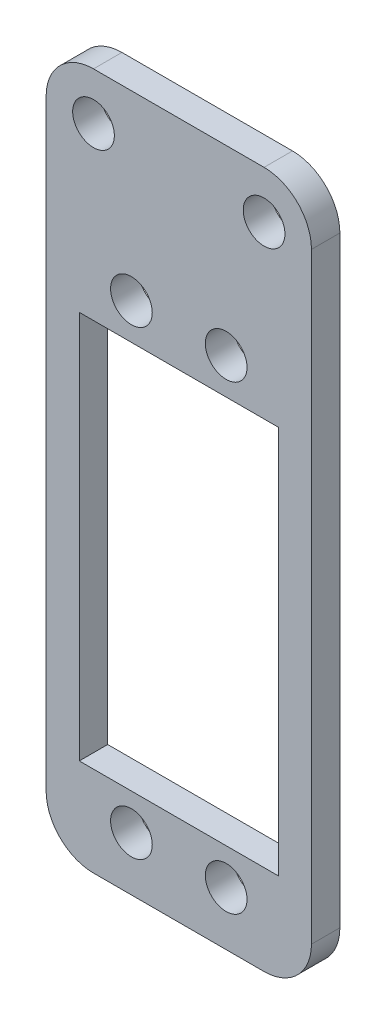
ISO-10303-21;
HEADER;
FILE_DESCRIPTION(('STEP AP214'),'2;1');
FILE_NAME('part.step','',(''),(''),'','','');
FILE_SCHEMA(('AUTOMOTIVE_DESIGN { 1 0 10303 214 1 1 1 1 }'));
ENDSEC;
DATA;
#1=APPLICATION_CONTEXT('core data for automotive mechanical design processes');
#2=APPLICATION_PROTOCOL_DEFINITION('international standard','automotive_design',2000,#1);
#3=PRODUCT_CONTEXT('',#1,'mechanical');
#4=PRODUCT('Part','Part','',(#3));
#5=PRODUCT_RELATED_PRODUCT_CATEGORY('part','',(#4));
#6=PRODUCT_DEFINITION_FORMATION('','',#4);
#7=PRODUCT_DEFINITION_CONTEXT('part definition',#1,'design');
#8=PRODUCT_DEFINITION('design','',#6,#7);
#9=PRODUCT_DEFINITION_SHAPE('','',#8);
#10=(LENGTH_UNIT() NAMED_UNIT(*) SI_UNIT(.MILLI.,.METRE.));
#11=(NAMED_UNIT(*) PLANE_ANGLE_UNIT() SI_UNIT($,.RADIAN.));
#12=(NAMED_UNIT(*) SI_UNIT($,.STERADIAN.) SOLID_ANGLE_UNIT());
#13=UNCERTAINTY_MEASURE_WITH_UNIT(LENGTH_MEASURE(1.E-05),#10,'distance_accuracy_value','');
#14=(GEOMETRIC_REPRESENTATION_CONTEXT(3) GLOBAL_UNCERTAINTY_ASSIGNED_CONTEXT((#13)) GLOBAL_UNIT_ASSIGNED_CONTEXT((#10,
#11,#12)) REPRESENTATION_CONTEXT('',''));
#15=CARTESIAN_POINT('',(0.,0.,0.));
#16=DIRECTION('',(0.,0.,1.));
#17=DIRECTION('',(1.,0.,0.));
#18=AXIS2_PLACEMENT_3D('',#15,#16,#17);
#19=CARTESIAN_POINT('',(-9.00000000000001,35.,3.));
#20=DIRECTION('',(0.,0.,-1.));
#21=DIRECTION('',(-1.,0.,0.));
#22=AXIS2_PLACEMENT_3D('',#19,#20,#21);
#23=PLANE('',#22);
#24=CARTESIAN_POINT('',(-9.00000000000001,35.,3.));
#25=DIRECTION('',(0.,0.,1.));
#26=DIRECTION('',(1.,0.,0.));
#27=AXIS2_PLACEMENT_3D('',#24,#25,#26);
#28=CIRCLE('',#27,2.2);
#29=CARTESIAN_POINT('',(-6.8,35.,3.));
#30=VERTEX_POINT('',#29);
#31=EDGE_CURVE('E366',#30,#30,#28,.T.);
#32=ORIENTED_EDGE('',*,*,#31,.F.);
#33=EDGE_LOOP('',(#32));
#34=FACE_BOUND('',#33,.T.);
#35=CARTESIAN_POINT('',(9.,35.,3.));
#36=DIRECTION('',(0.,0.,1.));
#37=DIRECTION('',(1.,0.,0.));
#38=AXIS2_PLACEMENT_3D('',#35,#36,#37);
#39=CIRCLE('',#38,2.2);
#40=CARTESIAN_POINT('',(11.2,35.,3.));
#41=VERTEX_POINT('',#40);
#42=EDGE_CURVE('E314',#41,#41,#39,.T.);
#43=ORIENTED_EDGE('',*,*,#42,.F.);
#44=EDGE_LOOP('',(#43));
#45=FACE_BOUND('',#44,.T.);
#46=DIRECTION('',(-1.,0.,0.));
#47=VECTOR('',#46,1.);
#48=CARTESIAN_POINT('',(0.,17.,3.));
#49=LINE('',#48,#47);
#50=CARTESIAN_POINT('',(10.5000000000001,17.,3.));
#51=VERTEX_POINT('',#50);
#52=CARTESIAN_POINT('',(-10.4999999999999,17.,3.));
#53=VERTEX_POINT('',#52);
#54=EDGE_CURVE('E156',#51,#53,#49,.T.);
#55=ORIENTED_EDGE('',*,*,#54,.F.);
#56=DIRECTION('',(0.,1.,0.));
#57=VECTOR('',#56,1.);
#58=CARTESIAN_POINT('',(10.5000000000001,0.,3.));
#59=LINE('',#58,#57);
#60=CARTESIAN_POINT('',(10.5000000000001,-24.,3.));
#61=VERTEX_POINT('',#60);
#62=EDGE_CURVE('E54',#61,#51,#59,.T.);
#63=ORIENTED_EDGE('',*,*,#62,.F.);
#64=DIRECTION('',(-1.,0.,0.));
#65=VECTOR('',#64,1.);
#66=CARTESIAN_POINT('',(0.,-24.,3.));
#67=LINE('',#66,#65);
#68=CARTESIAN_POINT('',(-10.4999999999999,-24.,3.));
#69=VERTEX_POINT('',#68);
#70=EDGE_CURVE('E144',#61,#69,#67,.T.);
#71=ORIENTED_EDGE('',*,*,#70,.T.);
#72=DIRECTION('',(0.,1.,0.));
#73=VECTOR('',#72,1.);
#74=CARTESIAN_POINT('',(-10.4999999999999,0.,3.));
#75=LINE('',#74,#73);
#76=EDGE_CURVE('E147',#69,#53,#75,.T.);
#77=ORIENTED_EDGE('',*,*,#76,.T.);
#78=EDGE_LOOP('',(#55,#63,#71,#77));
#79=FACE_BOUND('',#78,.T.);
#80=CARTESIAN_POINT('',(4.99999999999998,20.815,3.));
#81=DIRECTION('',(0.,0.,1.));
#82=DIRECTION('',(1.,0.,0.));
#83=AXIS2_PLACEMENT_3D('',#80,#81,#82);
#84=CIRCLE('',#83,2.2);
#85=CARTESIAN_POINT('',(7.19999999999998,20.815,3.));
#86=VERTEX_POINT('',#85);
#87=EDGE_CURVE('E319',#86,#86,#84,.T.);
#88=ORIENTED_EDGE('',*,*,#87,.F.);
#89=EDGE_LOOP('',(#88));
#90=FACE_BOUND('',#89,.T.);
#91=CARTESIAN_POINT('',(-4.99999999999999,20.815,3.));
#92=DIRECTION('',(0.,0.,1.));
#93=DIRECTION('',(1.,0.,0.));
#94=AXIS2_PLACEMENT_3D('',#91,#92,#93);
#95=CIRCLE('',#94,2.2);
#96=CARTESIAN_POINT('',(-2.79999999999999,20.815,3.));
#97=VERTEX_POINT('',#96);
#98=EDGE_CURVE('E170',#97,#97,#95,.F.);
#99=ORIENTED_EDGE('',*,*,#98,.T.);
#100=EDGE_LOOP('',(#99));
#101=FACE_BOUND('',#100,.T.);
#102=CARTESIAN_POINT('',(-9.00000000000001,35.,3.));
#103=DIRECTION('',(0.,0.,1.));
#104=DIRECTION('',(-1.,0.,0.));
#105=AXIS2_PLACEMENT_3D('',#102,#103,#104);
#106=CIRCLE('',#105,5.);
#107=CARTESIAN_POINT('',(-9.00000000000001,40.,3.));
#108=VERTEX_POINT('',#107);
#109=CARTESIAN_POINT('',(-14.,35.,3.));
#110=VERTEX_POINT('',#109);
#111=EDGE_CURVE('E174',#108,#110,#106,.T.);
#112=ORIENTED_EDGE('',*,*,#111,.T.);
#113=DIRECTION('',(0.,-1.,0.));
#114=VECTOR('',#113,1.);
#115=CARTESIAN_POINT('',(-14.,35.,3.));
#116=LINE('',#115,#114);
#117=CARTESIAN_POINT('',(-14.,-28.5,3.));
#118=VERTEX_POINT('',#117);
#119=EDGE_CURVE('E177',#110,#118,#116,.T.);
#120=ORIENTED_EDGE('',*,*,#119,.T.);
#121=CARTESIAN_POINT('',(-9.00000000000001,-28.5,3.));
#122=DIRECTION('',(0.,0.,1.));
#123=DIRECTION('',(-1.,0.,0.));
#124=AXIS2_PLACEMENT_3D('',#121,#122,#123);
#125=CIRCLE('',#124,5.);
#126=CARTESIAN_POINT('',(-8.99999999999997,-33.5,3.));
#127=VERTEX_POINT('',#126);
#128=EDGE_CURVE('E180',#118,#127,#125,.T.);
#129=ORIENTED_EDGE('',*,*,#128,.T.);
#130=DIRECTION('',(1.,0.,0.));
#131=VECTOR('',#130,1.);
#132=CARTESIAN_POINT('',(-8.99999999999997,-33.5,3.));
#133=LINE('',#132,#131);
#134=CARTESIAN_POINT('',(8.99999999999997,-33.5,3.));
#135=VERTEX_POINT('',#134);
#136=EDGE_CURVE('E182',#127,#135,#133,.T.);
#137=ORIENTED_EDGE('',*,*,#136,.T.);
#138=CARTESIAN_POINT('',(9.,-28.5,3.));
#139=DIRECTION('',(0.,0.,1.));
#140=DIRECTION('',(1.,0.,0.));
#141=AXIS2_PLACEMENT_3D('',#138,#139,#140);
#142=CIRCLE('',#141,5.);
#143=CARTESIAN_POINT('',(14.,-28.5,3.));
#144=VERTEX_POINT('',#143);
#145=EDGE_CURVE('E184',#135,#144,#142,.T.);
#146=ORIENTED_EDGE('',*,*,#145,.T.);
#147=DIRECTION('',(0.,1.,0.));
#148=VECTOR('',#147,1.);
#149=CARTESIAN_POINT('',(14.,35.,3.));
#150=LINE('',#149,#148);
#151=CARTESIAN_POINT('',(14.,35.,3.));
#152=VERTEX_POINT('',#151);
#153=EDGE_CURVE('E186',#144,#152,#150,.T.);
#154=ORIENTED_EDGE('',*,*,#153,.T.);
#155=CARTESIAN_POINT('',(9.,35.,3.));
#156=DIRECTION('',(0.,0.,1.));
#157=DIRECTION('',(1.,0.,0.));
#158=AXIS2_PLACEMENT_3D('',#155,#156,#157);
#159=CIRCLE('',#158,5.);
#160=CARTESIAN_POINT('',(9.,40.,3.));
#161=VERTEX_POINT('',#160);
#162=EDGE_CURVE('E188',#152,#161,#159,.T.);
#163=ORIENTED_EDGE('',*,*,#162,.T.);
#164=DIRECTION('',(-1.,0.,0.));
#165=VECTOR('',#164,1.);
#166=CARTESIAN_POINT('',(-9.00000000000001,40.,3.));
#167=LINE('',#166,#165);
#168=EDGE_CURVE('E190',#161,#108,#167,.T.);
#169=ORIENTED_EDGE('',*,*,#168,.T.);
#170=EDGE_LOOP('',(#112,#120,#129,#137,#146,#154,#163,#169));
#171=FACE_BOUND('',#170,.T.);
#172=CARTESIAN_POINT('',(4.99999999999999,-27.815,3.));
#173=DIRECTION('',(0.,0.,1.));
#174=DIRECTION('',(1.,0.,0.));
#175=AXIS2_PLACEMENT_3D('',#172,#173,#174);
#176=CIRCLE('',#175,2.2);
#177=CARTESIAN_POINT('',(7.19999999999999,-27.815,3.));
#178=VERTEX_POINT('',#177);
#179=EDGE_CURVE('E308',#178,#178,#176,.F.);
#180=ORIENTED_EDGE('',*,*,#179,.T.);
#181=EDGE_LOOP('',(#180));
#182=FACE_BOUND('',#181,.T.);
#183=CARTESIAN_POINT('',(-4.99999999999999,-27.815,3.));
#184=DIRECTION('',(0.,0.,1.));
#185=DIRECTION('',(1.,0.,0.));
#186=AXIS2_PLACEMENT_3D('',#183,#184,#185);
#187=CIRCLE('',#186,2.2);
#188=CARTESIAN_POINT('',(-2.79999999999999,-27.815,3.));
#189=VERTEX_POINT('',#188);
#190=EDGE_CURVE('E150',#189,#189,#187,.T.);
#191=ORIENTED_EDGE('',*,*,#190,.F.);
#192=EDGE_LOOP('',(#191));
#193=FACE_BOUND('',#192,.T.);
#194=ADVANCED_FACE('F39',(#34,#45,#79,#90,#101,#171,#182,#193),#23,.F.);
#195=CARTESIAN_POINT('',(-9.00000000000001,35.,0.));
#196=DIRECTION('',(0.,0.,-1.));
#197=DIRECTION('',(-1.,0.,0.));
#198=AXIS2_PLACEMENT_3D('',#195,#196,#197);
#199=PLANE('',#198);
#200=CARTESIAN_POINT('',(-9.00000000000001,35.,0.));
#201=DIRECTION('',(0.,0.,1.));
#202=DIRECTION('',(1.,0.,0.));
#203=AXIS2_PLACEMENT_3D('',#200,#201,#202);
#204=CIRCLE('',#203,2.2);
#205=CARTESIAN_POINT('',(-6.8,35.,0.));
#206=VERTEX_POINT('',#205);
#207=EDGE_CURVE('E321',#206,#206,#204,.T.);
#208=ORIENTED_EDGE('',*,*,#207,.T.);
#209=EDGE_LOOP('',(#208));
#210=FACE_BOUND('',#209,.T.);
#211=CARTESIAN_POINT('',(9.,35.,0.));
#212=DIRECTION('',(0.,0.,1.));
#213=DIRECTION('',(1.,0.,0.));
#214=AXIS2_PLACEMENT_3D('',#211,#212,#213);
#215=CIRCLE('',#214,2.2);
#216=CARTESIAN_POINT('',(11.2,35.,0.));
#217=VERTEX_POINT('',#216);
#218=EDGE_CURVE('E367',#217,#217,#215,.T.);
#219=ORIENTED_EDGE('',*,*,#218,.T.);
#220=EDGE_LOOP('',(#219));
#221=FACE_BOUND('',#220,.T.);
#222=CARTESIAN_POINT('',(4.99999999999998,20.815,0.));
#223=DIRECTION('',(0.,0.,1.));
#224=DIRECTION('',(1.,0.,0.));
#225=AXIS2_PLACEMENT_3D('',#222,#223,#224);
#226=CIRCLE('',#225,2.2);
#227=CARTESIAN_POINT('',(7.19999999999998,20.815,0.));
#228=VERTEX_POINT('',#227);
#229=EDGE_CURVE('E311',#228,#228,#226,.T.);
#230=ORIENTED_EDGE('',*,*,#229,.T.);
#231=EDGE_LOOP('',(#230));
#232=FACE_BOUND('',#231,.T.);
#233=CARTESIAN_POINT('',(-9.00000000000001,35.,0.));
#234=DIRECTION('',(0.,0.,1.));
#235=DIRECTION('',(-1.,0.,0.));
#236=AXIS2_PLACEMENT_3D('',#233,#234,#235);
#237=CIRCLE('',#236,5.);
#238=CARTESIAN_POINT('',(-9.00000000000001,40.,0.));
#239=VERTEX_POINT('',#238);
#240=CARTESIAN_POINT('',(-14.,35.,0.));
#241=VERTEX_POINT('',#240);
#242=EDGE_CURVE('E169',#239,#241,#237,.T.);
#243=ORIENTED_EDGE('',*,*,#242,.F.);
#244=DIRECTION('',(-1.,0.,0.));
#245=VECTOR('',#244,1.);
#246=CARTESIAN_POINT('',(-9.00000000000001,40.,0.));
#247=LINE('',#246,#245);
#248=CARTESIAN_POINT('',(9.,40.,0.));
#249=VERTEX_POINT('',#248);
#250=EDGE_CURVE('E178',#249,#239,#247,.T.);
#251=ORIENTED_EDGE('',*,*,#250,.F.);
#252=CARTESIAN_POINT('',(9.,35.,0.));
#253=DIRECTION('',(0.,0.,1.));
#254=DIRECTION('',(1.,0.,0.));
#255=AXIS2_PLACEMENT_3D('',#252,#253,#254);
#256=CIRCLE('',#255,5.);
#257=CARTESIAN_POINT('',(14.,35.,0.));
#258=VERTEX_POINT('',#257);
#259=EDGE_CURVE('E205',#258,#249,#256,.T.);
#260=ORIENTED_EDGE('',*,*,#259,.F.);
#261=DIRECTION('',(0.,1.,0.));
#262=VECTOR('',#261,1.);
#263=CARTESIAN_POINT('',(14.,35.,0.));
#264=LINE('',#263,#262);
#265=CARTESIAN_POINT('',(14.,-28.5,0.));
#266=VERTEX_POINT('',#265);
#267=EDGE_CURVE('E203',#266,#258,#264,.T.);
#268=ORIENTED_EDGE('',*,*,#267,.F.);
#269=CARTESIAN_POINT('',(9.,-28.5,0.));
#270=DIRECTION('',(0.,0.,1.));
#271=DIRECTION('',(1.,0.,0.));
#272=AXIS2_PLACEMENT_3D('',#269,#270,#271);
#273=CIRCLE('',#272,5.);
#274=CARTESIAN_POINT('',(8.99999999999997,-33.5,0.));
#275=VERTEX_POINT('',#274);
#276=EDGE_CURVE('E201',#275,#266,#273,.T.);
#277=ORIENTED_EDGE('',*,*,#276,.F.);
#278=DIRECTION('',(1.,0.,0.));
#279=VECTOR('',#278,1.);
#280=CARTESIAN_POINT('',(-8.99999999999997,-33.5,0.));
#281=LINE('',#280,#279);
#282=CARTESIAN_POINT('',(-8.99999999999997,-33.5,0.));
#283=VERTEX_POINT('',#282);
#284=EDGE_CURVE('E199',#283,#275,#281,.T.);
#285=ORIENTED_EDGE('',*,*,#284,.F.);
#286=CARTESIAN_POINT('',(-9.00000000000001,-28.5,0.));
#287=DIRECTION('',(0.,0.,1.));
#288=DIRECTION('',(-1.,0.,0.));
#289=AXIS2_PLACEMENT_3D('',#286,#287,#288);
#290=CIRCLE('',#289,5.);
#291=CARTESIAN_POINT('',(-14.,-28.5,0.));
#292=VERTEX_POINT('',#291);
#293=EDGE_CURVE('E197',#292,#283,#290,.T.);
#294=ORIENTED_EDGE('',*,*,#293,.F.);
#295=DIRECTION('',(0.,-1.,0.));
#296=VECTOR('',#295,1.);
#297=CARTESIAN_POINT('',(-14.,35.,0.));
#298=LINE('',#297,#296);
#299=EDGE_CURVE('E195',#241,#292,#298,.T.);
#300=ORIENTED_EDGE('',*,*,#299,.F.);
#301=EDGE_LOOP('',(#243,#251,#260,#268,#277,#285,#294,#300));
#302=FACE_BOUND('',#301,.T.);
#303=CARTESIAN_POINT('',(-4.99999999999999,20.815,0.));
#304=DIRECTION('',(0.,0.,1.));
#305=DIRECTION('',(1.,0.,0.));
#306=AXIS2_PLACEMENT_3D('',#303,#304,#305);
#307=CIRCLE('',#306,2.2);
#308=CARTESIAN_POINT('',(-2.79999999999999,20.815,0.));
#309=VERTEX_POINT('',#308);
#310=EDGE_CURVE('E166',#309,#309,#307,.F.);
#311=ORIENTED_EDGE('',*,*,#310,.F.);
#312=EDGE_LOOP('',(#311));
#313=FACE_BOUND('',#312,.T.);
#314=CARTESIAN_POINT('',(4.99999999999999,-27.815,0.));
#315=DIRECTION('',(0.,0.,1.));
#316=DIRECTION('',(1.,0.,0.));
#317=AXIS2_PLACEMENT_3D('',#314,#315,#316);
#318=CIRCLE('',#317,2.2);
#319=CARTESIAN_POINT('',(7.19999999999999,-27.815,0.));
#320=VERTEX_POINT('',#319);
#321=EDGE_CURVE('E157',#320,#320,#318,.F.);
#322=ORIENTED_EDGE('',*,*,#321,.F.);
#323=EDGE_LOOP('',(#322));
#324=FACE_BOUND('',#323,.T.);
#325=DIRECTION('',(0.,1.,0.));
#326=VECTOR('',#325,1.);
#327=CARTESIAN_POINT('',(10.5000000000001,0.,0.));
#328=LINE('',#327,#326);
#329=CARTESIAN_POINT('',(10.5000000000001,-24.,0.));
#330=VERTEX_POINT('',#329);
#331=CARTESIAN_POINT('',(10.5000000000001,17.,0.));
#332=VERTEX_POINT('',#331);
#333=EDGE_CURVE('E130',#330,#332,#328,.T.);
#334=ORIENTED_EDGE('',*,*,#333,.T.);
#335=DIRECTION('',(-1.,0.,0.));
#336=VECTOR('',#335,1.);
#337=CARTESIAN_POINT('',(0.,17.,0.));
#338=LINE('',#337,#336);
#339=CARTESIAN_POINT('',(-10.4999999999999,17.,0.));
#340=VERTEX_POINT('',#339);
#341=EDGE_CURVE('E136',#332,#340,#338,.T.);
#342=ORIENTED_EDGE('',*,*,#341,.T.);
#343=DIRECTION('',(0.,1.,0.));
#344=VECTOR('',#343,1.);
#345=CARTESIAN_POINT('',(-10.4999999999999,0.,0.));
#346=LINE('',#345,#344);
#347=CARTESIAN_POINT('',(-10.4999999999999,-24.,0.));
#348=VERTEX_POINT('',#347);
#349=EDGE_CURVE('E140',#348,#340,#346,.T.);
#350=ORIENTED_EDGE('',*,*,#349,.F.);
#351=DIRECTION('',(-1.,0.,0.));
#352=VECTOR('',#351,1.);
#353=CARTESIAN_POINT('',(0.,-24.,0.));
#354=LINE('',#353,#352);
#355=EDGE_CURVE('E133',#330,#348,#354,.T.);
#356=ORIENTED_EDGE('',*,*,#355,.F.);
#357=EDGE_LOOP('',(#334,#342,#350,#356));
#358=FACE_BOUND('',#357,.T.);
#359=CARTESIAN_POINT('',(-4.99999999999999,-27.815,0.));
#360=DIRECTION('',(0.,0.,1.));
#361=DIRECTION('',(1.,0.,0.));
#362=AXIS2_PLACEMENT_3D('',#359,#360,#361);
#363=CIRCLE('',#362,2.2);
#364=CARTESIAN_POINT('',(-2.79999999999999,-27.815,0.));
#365=VERTEX_POINT('',#364);
#366=EDGE_CURVE('E173',#365,#365,#363,.T.);
#367=ORIENTED_EDGE('',*,*,#366,.T.);
#368=EDGE_LOOP('',(#367));
#369=FACE_BOUND('',#368,.T.);
#370=ADVANCED_FACE('F142',(#210,#221,#232,#302,#313,#324,#358,#369),#199,.T.);
#371=CARTESIAN_POINT('',(-9.00000000000001,35.,3.));
#372=DIRECTION('',(0.,0.,-1.));
#373=DIRECTION('',(-1.,0.,0.));
#374=AXIS2_PLACEMENT_3D('',#371,#372,#373);
#375=CYLINDRICAL_SURFACE('',#374,5.);
#376=ORIENTED_EDGE('',*,*,#242,.T.);
#377=DIRECTION('',(0.,0.,-1.));
#378=VECTOR('',#377,1.);
#379=CARTESIAN_POINT('',(-14.,35.,3.));
#380=LINE('',#379,#378);
#381=EDGE_CURVE('E11',#110,#241,#380,.T.);
#382=ORIENTED_EDGE('',*,*,#381,.F.);
#383=ORIENTED_EDGE('',*,*,#111,.F.);
#384=DIRECTION('',(0.,0.,-1.));
#385=VECTOR('',#384,1.);
#386=CARTESIAN_POINT('',(-9.00000000000001,40.,3.));
#387=LINE('',#386,#385);
#388=EDGE_CURVE('E192',#108,#239,#387,.T.);
#389=ORIENTED_EDGE('',*,*,#388,.T.);
#390=EDGE_LOOP('',(#376,#382,#383,#389));
#391=FACE_BOUND('',#390,.T.);
#392=ADVANCED_FACE('F41',(#391),#375,.T.);
#393=CARTESIAN_POINT('',(-14.,35.,3.));
#394=DIRECTION('',(1.,0.,0.));
#395=DIRECTION('',(0.,1.,0.));
#396=AXIS2_PLACEMENT_3D('',#393,#394,#395);
#397=PLANE('',#396);
#398=ORIENTED_EDGE('',*,*,#299,.T.);
#399=DIRECTION('',(0.,0.,-1.));
#400=VECTOR('',#399,1.);
#401=CARTESIAN_POINT('',(-14.,-28.5,3.));
#402=LINE('',#401,#400);
#403=EDGE_CURVE('E47',#118,#292,#402,.T.);
#404=ORIENTED_EDGE('',*,*,#403,.F.);
#405=ORIENTED_EDGE('',*,*,#119,.F.);
#406=ORIENTED_EDGE('',*,*,#381,.T.);
#407=EDGE_LOOP('',(#398,#404,#405,#406));
#408=FACE_BOUND('',#407,.T.);
#409=ADVANCED_FACE('F252',(#408),#397,.F.);
#410=CARTESIAN_POINT('',(-9.00000000000001,-28.5,3.));
#411=DIRECTION('',(0.,0.,-1.));
#412=DIRECTION('',(-1.,0.,0.));
#413=AXIS2_PLACEMENT_3D('',#410,#411,#412);
#414=CYLINDRICAL_SURFACE('',#413,5.);
#415=ORIENTED_EDGE('',*,*,#293,.T.);
#416=DIRECTION('',(0.,0.,-1.));
#417=VECTOR('',#416,1.);
#418=CARTESIAN_POINT('',(-8.99999999999997,-33.5,3.));
#419=LINE('',#418,#417);
#420=EDGE_CURVE('E222',#127,#283,#419,.T.);
#421=ORIENTED_EDGE('',*,*,#420,.F.);
#422=ORIENTED_EDGE('',*,*,#128,.F.);
#423=ORIENTED_EDGE('',*,*,#403,.T.);
#424=EDGE_LOOP('',(#415,#421,#422,#423));
#425=FACE_BOUND('',#424,.T.);
#426=ADVANCED_FACE('F229',(#425),#414,.T.);
#427=CARTESIAN_POINT('',(-8.99999999999997,-33.5,3.));
#428=DIRECTION('',(0.,1.,0.));
#429=DIRECTION('',(0.,0.,1.));
#430=AXIS2_PLACEMENT_3D('',#427,#428,#429);
#431=PLANE('',#430);
#432=ORIENTED_EDGE('',*,*,#284,.T.);
#433=DIRECTION('',(0.,0.,-1.));
#434=VECTOR('',#433,1.);
#435=CARTESIAN_POINT('',(8.99999999999997,-33.5,3.));
#436=LINE('',#435,#434);
#437=EDGE_CURVE('E219',#135,#275,#436,.T.);
#438=ORIENTED_EDGE('',*,*,#437,.F.);
#439=ORIENTED_EDGE('',*,*,#136,.F.);
#440=ORIENTED_EDGE('',*,*,#420,.T.);
#441=EDGE_LOOP('',(#432,#438,#439,#440));
#442=FACE_BOUND('',#441,.T.);
#443=ADVANCED_FACE('F240',(#442),#431,.F.);
#444=CARTESIAN_POINT('',(9.,-28.5,3.));
#445=DIRECTION('',(0.,0.,-1.));
#446=DIRECTION('',(-1.,0.,0.));
#447=AXIS2_PLACEMENT_3D('',#444,#445,#446);
#448=CYLINDRICAL_SURFACE('',#447,5.);
#449=ORIENTED_EDGE('',*,*,#276,.T.);
#450=DIRECTION('',(0.,0.,-1.));
#451=VECTOR('',#450,1.);
#452=CARTESIAN_POINT('',(14.,-28.5,3.));
#453=LINE('',#452,#451);
#454=EDGE_CURVE('E216',#144,#266,#453,.T.);
#455=ORIENTED_EDGE('',*,*,#454,.F.);
#456=ORIENTED_EDGE('',*,*,#145,.F.);
#457=ORIENTED_EDGE('',*,*,#437,.T.);
#458=EDGE_LOOP('',(#449,#455,#456,#457));
#459=FACE_BOUND('',#458,.T.);
#460=ADVANCED_FACE('F244',(#459),#448,.T.);
#461=CARTESIAN_POINT('',(14.,35.,3.));
#462=DIRECTION('',(-1.,0.,0.));
#463=DIRECTION('',(0.,-1.,0.));
#464=AXIS2_PLACEMENT_3D('',#461,#462,#463);
#465=PLANE('',#464);
#466=ORIENTED_EDGE('',*,*,#267,.T.);
#467=DIRECTION('',(0.,0.,-1.));
#468=VECTOR('',#467,1.);
#469=CARTESIAN_POINT('',(14.,35.,3.));
#470=LINE('',#469,#468);
#471=EDGE_CURVE('E213',#152,#258,#470,.T.);
#472=ORIENTED_EDGE('',*,*,#471,.F.);
#473=ORIENTED_EDGE('',*,*,#153,.F.);
#474=ORIENTED_EDGE('',*,*,#454,.T.);
#475=EDGE_LOOP('',(#466,#472,#473,#474));
#476=FACE_BOUND('',#475,.T.);
#477=ADVANCED_FACE('F265',(#476),#465,.F.);
#478=CARTESIAN_POINT('',(9.,35.,3.));
#479=DIRECTION('',(0.,0.,-1.));
#480=DIRECTION('',(-1.,0.,0.));
#481=AXIS2_PLACEMENT_3D('',#478,#479,#480);
#482=CYLINDRICAL_SURFACE('',#481,5.);
#483=ORIENTED_EDGE('',*,*,#259,.T.);
#484=DIRECTION('',(0.,0.,-1.));
#485=VECTOR('',#484,1.);
#486=CARTESIAN_POINT('',(9.,40.,3.));
#487=LINE('',#486,#485);
#488=EDGE_CURVE('E210',#161,#249,#487,.T.);
#489=ORIENTED_EDGE('',*,*,#488,.F.);
#490=ORIENTED_EDGE('',*,*,#162,.F.);
#491=ORIENTED_EDGE('',*,*,#471,.T.);
#492=EDGE_LOOP('',(#483,#489,#490,#491));
#493=FACE_BOUND('',#492,.T.);
#494=ADVANCED_FACE('F263',(#493),#482,.T.);
#495=CARTESIAN_POINT('',(-9.00000000000001,40.,3.));
#496=DIRECTION('',(0.,-1.,0.));
#497=DIRECTION('',(1.,0.,0.));
#498=AXIS2_PLACEMENT_3D('',#495,#496,#497);
#499=PLANE('',#498);
#500=ORIENTED_EDGE('',*,*,#250,.T.);
#501=ORIENTED_EDGE('',*,*,#388,.F.);
#502=ORIENTED_EDGE('',*,*,#168,.F.);
#503=ORIENTED_EDGE('',*,*,#488,.T.);
#504=EDGE_LOOP('',(#500,#501,#502,#503));
#505=FACE_BOUND('',#504,.T.);
#506=ADVANCED_FACE('F258',(#505),#499,.F.);
#507=CARTESIAN_POINT('',(-4.99999999999999,20.815,0.));
#508=DIRECTION('',(0.,0.,1.));
#509=DIRECTION('',(1.,0.,0.));
#510=AXIS2_PLACEMENT_3D('',#507,#508,#509);
#511=CYLINDRICAL_SURFACE('',#510,2.2);
#512=ORIENTED_EDGE('',*,*,#310,.T.);
#513=EDGE_LOOP('',(#512));
#514=FACE_BOUND('',#513,.T.);
#515=ORIENTED_EDGE('',*,*,#98,.F.);
#516=EDGE_LOOP('',(#515));
#517=FACE_BOUND('',#516,.T.);
#518=ADVANCED_FACE('F285',(#514,#517),#511,.F.);
#519=CARTESIAN_POINT('',(4.99999999999998,20.815,0.));
#520=DIRECTION('',(0.,0.,1.));
#521=DIRECTION('',(1.,0.,0.));
#522=AXIS2_PLACEMENT_3D('',#519,#520,#521);
#523=CYLINDRICAL_SURFACE('',#522,2.2);
#524=ORIENTED_EDGE('',*,*,#229,.F.);
#525=EDGE_LOOP('',(#524));
#526=FACE_BOUND('',#525,.T.);
#527=ORIENTED_EDGE('',*,*,#87,.T.);
#528=EDGE_LOOP('',(#527));
#529=FACE_BOUND('',#528,.T.);
#530=ADVANCED_FACE('F292',(#526,#529),#523,.F.);
#531=CARTESIAN_POINT('',(4.99999999999999,-27.815,0.));
#532=DIRECTION('',(0.,0.,1.));
#533=DIRECTION('',(1.,0.,0.));
#534=AXIS2_PLACEMENT_3D('',#531,#532,#533);
#535=CYLINDRICAL_SURFACE('',#534,2.2);
#536=ORIENTED_EDGE('',*,*,#321,.T.);
#537=EDGE_LOOP('',(#536));
#538=FACE_BOUND('',#537,.T.);
#539=ORIENTED_EDGE('',*,*,#179,.F.);
#540=EDGE_LOOP('',(#539));
#541=FACE_BOUND('',#540,.T.);
#542=ADVANCED_FACE('F297',(#538,#541),#535,.F.);
#543=CARTESIAN_POINT('',(10.5000000000001,0.,0.));
#544=DIRECTION('',(1.,0.,0.));
#545=DIRECTION('',(0.,0.,-1.));
#546=AXIS2_PLACEMENT_3D('',#543,#544,#545);
#547=PLANE('',#546);
#548=ORIENTED_EDGE('',*,*,#62,.T.);
#549=DIRECTION('',(0.,0.,1.));
#550=VECTOR('',#549,1.);
#551=CARTESIAN_POINT('',(10.5000000000001,17.,0.));
#552=LINE('',#551,#550);
#553=EDGE_CURVE('E127',#332,#51,#552,.T.);
#554=ORIENTED_EDGE('',*,*,#553,.F.);
#555=ORIENTED_EDGE('',*,*,#333,.F.);
#556=DIRECTION('',(0.,0.,1.));
#557=VECTOR('',#556,1.);
#558=CARTESIAN_POINT('',(10.5000000000001,-24.,0.));
#559=LINE('',#558,#557);
#560=EDGE_CURVE('E161',#330,#61,#559,.T.);
#561=ORIENTED_EDGE('',*,*,#560,.T.);
#562=EDGE_LOOP('',(#548,#554,#555,#561));
#563=FACE_BOUND('',#562,.T.);
#564=ADVANCED_FACE('F128',(#563),#547,.F.);
#565=CARTESIAN_POINT('',(0.,-24.,0.));
#566=DIRECTION('',(0.,1.,0.));
#567=DIRECTION('',(0.,0.,1.));
#568=AXIS2_PLACEMENT_3D('',#565,#566,#567);
#569=PLANE('',#568);
#570=ORIENTED_EDGE('',*,*,#70,.F.);
#571=ORIENTED_EDGE('',*,*,#560,.F.);
#572=ORIENTED_EDGE('',*,*,#355,.T.);
#573=DIRECTION('',(0.,0.,1.));
#574=VECTOR('',#573,1.);
#575=CARTESIAN_POINT('',(-10.4999999999999,-24.,0.));
#576=LINE('',#575,#574);
#577=EDGE_CURVE('E163',#348,#69,#576,.T.);
#578=ORIENTED_EDGE('',*,*,#577,.T.);
#579=EDGE_LOOP('',(#570,#571,#572,#578));
#580=FACE_BOUND('',#579,.T.);
#581=ADVANCED_FACE('F344',(#580),#569,.T.);
#582=CARTESIAN_POINT('',(-10.4999999999999,0.,0.));
#583=DIRECTION('',(1.,0.,0.));
#584=DIRECTION('',(0.,1.,0.));
#585=AXIS2_PLACEMENT_3D('',#582,#583,#584);
#586=PLANE('',#585);
#587=ORIENTED_EDGE('',*,*,#76,.F.);
#588=ORIENTED_EDGE('',*,*,#577,.F.);
#589=ORIENTED_EDGE('',*,*,#349,.T.);
#590=DIRECTION('',(0.,0.,1.));
#591=VECTOR('',#590,1.);
#592=CARTESIAN_POINT('',(-10.4999999999999,17.,0.));
#593=LINE('',#592,#591);
#594=EDGE_CURVE('E62',#340,#53,#593,.T.);
#595=ORIENTED_EDGE('',*,*,#594,.T.);
#596=EDGE_LOOP('',(#587,#588,#589,#595));
#597=FACE_BOUND('',#596,.T.);
#598=ADVANCED_FACE('F340',(#597),#586,.T.);
#599=CARTESIAN_POINT('',(0.,17.,0.));
#600=DIRECTION('',(0.,1.,0.));
#601=DIRECTION('',(-1.,0.,0.));
#602=AXIS2_PLACEMENT_3D('',#599,#600,#601);
#603=PLANE('',#602);
#604=ORIENTED_EDGE('',*,*,#54,.T.);
#605=ORIENTED_EDGE('',*,*,#594,.F.);
#606=ORIENTED_EDGE('',*,*,#341,.F.);
#607=ORIENTED_EDGE('',*,*,#553,.T.);
#608=EDGE_LOOP('',(#604,#605,#606,#607));
#609=FACE_BOUND('',#608,.T.);
#610=ADVANCED_FACE('F137',(#609),#603,.F.);
#611=CARTESIAN_POINT('',(-4.99999999999999,-27.815,0.));
#612=DIRECTION('',(0.,0.,1.));
#613=DIRECTION('',(1.,0.,0.));
#614=AXIS2_PLACEMENT_3D('',#611,#612,#613);
#615=CYLINDRICAL_SURFACE('',#614,2.2);
#616=ORIENTED_EDGE('',*,*,#366,.F.);
#617=EDGE_LOOP('',(#616));
#618=FACE_BOUND('',#617,.T.);
#619=ORIENTED_EDGE('',*,*,#190,.T.);
#620=EDGE_LOOP('',(#619));
#621=FACE_BOUND('',#620,.T.);
#622=ADVANCED_FACE('F327',(#618,#621),#615,.F.);
#623=CARTESIAN_POINT('',(9.,35.,0.));
#624=DIRECTION('',(0.,0.,1.));
#625=DIRECTION('',(1.,0.,0.));
#626=AXIS2_PLACEMENT_3D('',#623,#624,#625);
#627=CYLINDRICAL_SURFACE('',#626,2.2);
#628=ORIENTED_EDGE('',*,*,#218,.F.);
#629=EDGE_LOOP('',(#628));
#630=FACE_BOUND('',#629,.T.);
#631=ORIENTED_EDGE('',*,*,#42,.T.);
#632=EDGE_LOOP('',(#631));
#633=FACE_BOUND('',#632,.T.);
#634=ADVANCED_FACE('F330',(#630,#633),#627,.F.);
#635=CARTESIAN_POINT('',(-9.00000000000001,35.,0.));
#636=DIRECTION('',(0.,0.,1.));
#637=DIRECTION('',(1.,0.,0.));
#638=AXIS2_PLACEMENT_3D('',#635,#636,#637);
#639=CYLINDRICAL_SURFACE('',#638,2.2);
#640=ORIENTED_EDGE('',*,*,#207,.F.);
#641=EDGE_LOOP('',(#640));
#642=FACE_BOUND('',#641,.T.);
#643=ORIENTED_EDGE('',*,*,#31,.T.);
#644=EDGE_LOOP('',(#643));
#645=FACE_BOUND('',#644,.T.);
#646=ADVANCED_FACE('F337',(#642,#645),#639,.F.);
#647=CLOSED_SHELL('',(#194,#370,#392,#409,#426,#443,#460,#477,#494,#506,#518,#530,#542,#564,
#581,#598,#610,#622,#634,#646));
#648=MANIFOLD_SOLID_BREP('B2',#647);
#649=ADVANCED_BREP_SHAPE_REPRESENTATION('',(#18,#648),#14);
#650=SHAPE_DEFINITION_REPRESENTATION(#9,#649);
ENDSEC;
END-ISO-10303-21;
